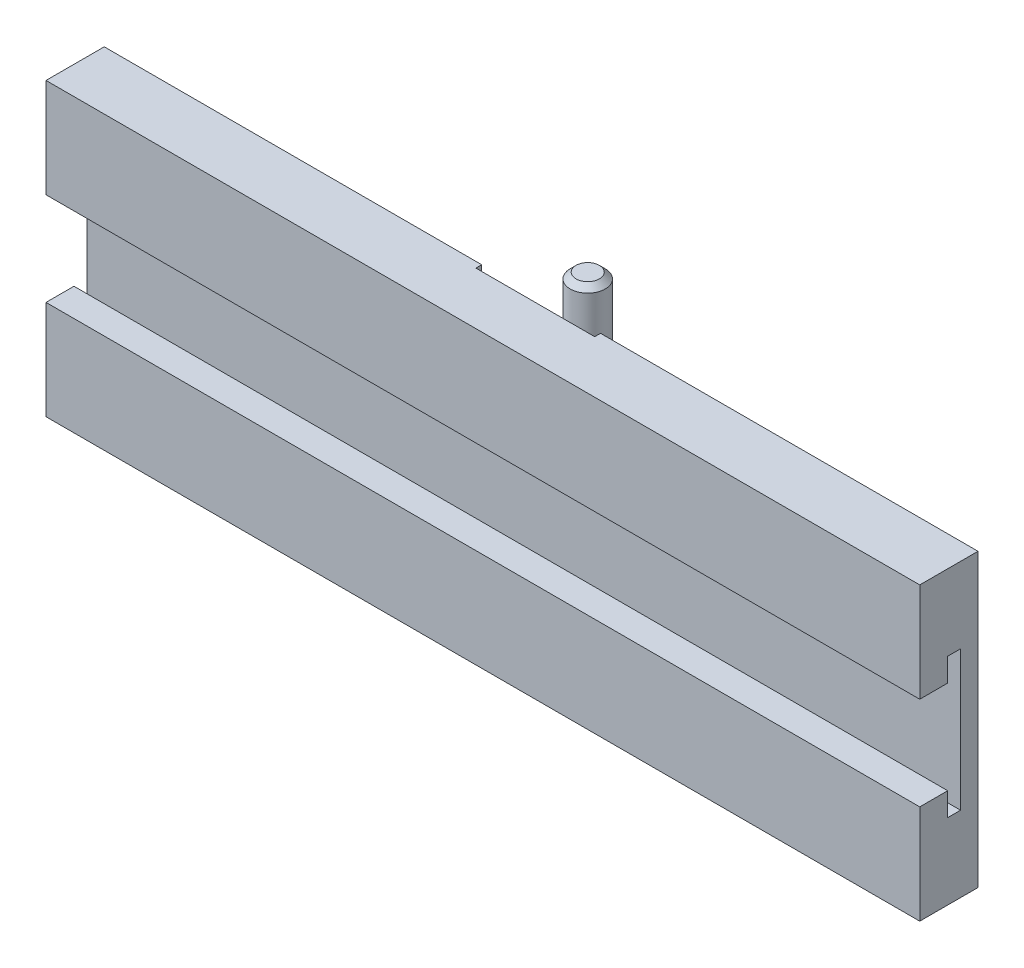
ISO-10303-21;
HEADER;
FILE_DESCRIPTION(('STEP AP214'),'2;1');
FILE_NAME('part.step','',(''),(''),'','','');
FILE_SCHEMA(('AUTOMOTIVE_DESIGN { 1 0 10303 214 1 1 1 1 }'));
ENDSEC;
DATA;
#1=APPLICATION_CONTEXT('core data for automotive mechanical design processes');
#2=APPLICATION_PROTOCOL_DEFINITION('international standard','automotive_design',2000,#1);
#3=PRODUCT_CONTEXT('',#1,'mechanical');
#4=PRODUCT('Part','Part','',(#3));
#5=PRODUCT_RELATED_PRODUCT_CATEGORY('part','',(#4));
#6=PRODUCT_DEFINITION_FORMATION('','',#4);
#7=PRODUCT_DEFINITION_CONTEXT('part definition',#1,'design');
#8=PRODUCT_DEFINITION('design','',#6,#7);
#9=PRODUCT_DEFINITION_SHAPE('','',#8);
#10=(LENGTH_UNIT() NAMED_UNIT(*) SI_UNIT(.MILLI.,.METRE.));
#11=(NAMED_UNIT(*) PLANE_ANGLE_UNIT() SI_UNIT($,.RADIAN.));
#12=(NAMED_UNIT(*) SI_UNIT($,.STERADIAN.) SOLID_ANGLE_UNIT());
#13=UNCERTAINTY_MEASURE_WITH_UNIT(LENGTH_MEASURE(1.E-05),#10,'distance_accuracy_value','');
#14=(GEOMETRIC_REPRESENTATION_CONTEXT(3) GLOBAL_UNCERTAINTY_ASSIGNED_CONTEXT((#13)) GLOBAL_UNIT_ASSIGNED_CONTEXT((#10,
#11,#12)) REPRESENTATION_CONTEXT('',''));
#15=CARTESIAN_POINT('',(0.,0.,0.));
#16=DIRECTION('',(0.,0.,1.));
#17=DIRECTION('',(1.,0.,0.));
#18=AXIS2_PLACEMENT_3D('',#15,#16,#17);
#19=CARTESIAN_POINT('',(40.0694316593444,-100.,0.999999999999995));
#20=DIRECTION('',(0.,0.,1.));
#21=DIRECTION('',(1.,0.,0.));
#22=AXIS2_PLACEMENT_3D('',#19,#20,#21);
#23=PLANE('',#22);
#24=DIRECTION('',(1.,0.,0.));
#25=VECTOR('',#24,1.);
#26=CARTESIAN_POINT('',(40.0694316593444,5.,0.999999999999995));
#27=LINE('',#26,#25);
#28=CARTESIAN_POINT('',(40.0694316593444,5.,0.999999999999995));
#29=VERTEX_POINT('',#28);
#30=CARTESIAN_POINT('',(60.4694316593444,5.,0.999999999999995));
#31=VERTEX_POINT('',#30);
#32=EDGE_CURVE('E197',#29,#31,#27,.T.);
#33=ORIENTED_EDGE('',*,*,#32,.F.);
#34=DIRECTION('',(0.,1.,0.));
#35=VECTOR('',#34,1.);
#36=CARTESIAN_POINT('',(40.0694316593444,-100.,0.999999999999995));
#37=LINE('',#36,#35);
#38=CARTESIAN_POINT('',(40.0694316593444,50.,0.999999999999995));
#39=VERTEX_POINT('',#38);
#40=EDGE_CURVE('E248',#29,#39,#37,.T.);
#41=ORIENTED_EDGE('',*,*,#40,.T.);
#42=DIRECTION('',(1.,0.,0.));
#43=VECTOR('',#42,1.);
#44=CARTESIAN_POINT('',(40.0694316593444,50.,0.999999999999995));
#45=LINE('',#44,#43);
#46=CARTESIAN_POINT('',(60.4694316593444,50.,0.999999999999995));
#47=VERTEX_POINT('',#46);
#48=EDGE_CURVE('E241',#39,#47,#45,.T.);
#49=ORIENTED_EDGE('',*,*,#48,.T.);
#50=DIRECTION('',(0.,1.,0.));
#51=VECTOR('',#50,1.);
#52=CARTESIAN_POINT('',(60.4694316593444,-100.,0.999999999999995));
#53=LINE('',#52,#51);
#54=EDGE_CURVE('E249',#31,#47,#53,.T.);
#55=ORIENTED_EDGE('',*,*,#54,.F.);
#56=EDGE_LOOP('',(#33,#41,#49,#55));
#57=FACE_BOUND('',#56,.T.);
#58=ADVANCED_FACE('F45',(#57),#23,.F.);
#59=CARTESIAN_POINT('',(40.0694316593444,-100.,0.));
#60=DIRECTION('',(-1.,0.,0.));
#61=DIRECTION('',(0.,0.,1.));
#62=AXIS2_PLACEMENT_3D('',#59,#60,#61);
#63=PLANE('',#62);
#64=DIRECTION('',(0.,0.,1.));
#65=VECTOR('',#64,1.);
#66=CARTESIAN_POINT('',(40.0694316593444,5.,-11.));
#67=LINE('',#66,#65);
#68=CARTESIAN_POINT('',(40.0694316593444,5.,0.));
#69=VERTEX_POINT('',#68);
#70=EDGE_CURVE('E233',#69,#29,#67,.T.);
#71=ORIENTED_EDGE('',*,*,#70,.F.);
#72=DIRECTION('',(0.,-1.,0.));
#73=VECTOR('',#72,1.);
#74=CARTESIAN_POINT('',(40.0694316593444,0.,0.));
#75=LINE('',#74,#73);
#76=CARTESIAN_POINT('',(40.0694316593444,50.,0.));
#77=VERTEX_POINT('',#76);
#78=EDGE_CURVE('E388',#77,#69,#75,.T.);
#79=ORIENTED_EDGE('',*,*,#78,.F.);
#80=DIRECTION('',(0.,0.,1.));
#81=VECTOR('',#80,1.);
#82=CARTESIAN_POINT('',(40.0694316593444,50.,0.));
#83=LINE('',#82,#81);
#84=EDGE_CURVE('E237',#77,#39,#83,.T.);
#85=ORIENTED_EDGE('',*,*,#84,.T.);
#86=ORIENTED_EDGE('',*,*,#40,.F.);
#87=EDGE_LOOP('',(#71,#79,#85,#86));
#88=FACE_BOUND('',#87,.T.);
#89=ADVANCED_FACE('F408',(#88),#63,.F.);
#90=CARTESIAN_POINT('',(60.4694316593444,-100.,0.));
#91=DIRECTION('',(1.,0.,0.));
#92=DIRECTION('',(0.,0.,-1.));
#93=AXIS2_PLACEMENT_3D('',#90,#91,#92);
#94=PLANE('',#93);
#95=DIRECTION('',(0.,0.,-1.));
#96=VECTOR('',#95,1.);
#97=CARTESIAN_POINT('',(60.4694316593444,5.,0.));
#98=LINE('',#97,#96);
#99=CARTESIAN_POINT('',(60.4694316593444,5.,0.));
#100=VERTEX_POINT('',#99);
#101=EDGE_CURVE('E392',#31,#100,#98,.T.);
#102=ORIENTED_EDGE('',*,*,#101,.F.);
#103=ORIENTED_EDGE('',*,*,#54,.T.);
#104=DIRECTION('',(0.,0.,-1.));
#105=VECTOR('',#104,1.);
#106=CARTESIAN_POINT('',(60.4694316593444,50.,0.));
#107=LINE('',#106,#105);
#108=CARTESIAN_POINT('',(60.4694316593444,50.,0.));
#109=VERTEX_POINT('',#108);
#110=EDGE_CURVE('E245',#47,#109,#107,.T.);
#111=ORIENTED_EDGE('',*,*,#110,.T.);
#112=DIRECTION('',(0.,1.,0.));
#113=VECTOR('',#112,1.);
#114=CARTESIAN_POINT('',(60.4694316593444,0.,0.));
#115=LINE('',#114,#113);
#116=EDGE_CURVE('E69',#100,#109,#115,.T.);
#117=ORIENTED_EDGE('',*,*,#116,.F.);
#118=EDGE_LOOP('',(#102,#103,#111,#117));
#119=FACE_BOUND('',#118,.T.);
#120=ADVANCED_FACE('F414',(#119),#94,.F.);
#121=CARTESIAN_POINT('',(0.,0.,0.));
#122=DIRECTION('',(0.,0.,1.));
#123=DIRECTION('',(1.,0.,0.));
#124=AXIS2_PLACEMENT_3D('',#121,#122,#123);
#125=PLANE('',#124);
#126=DIRECTION('',(1.,0.,0.));
#127=VECTOR('',#126,1.);
#128=CARTESIAN_POINT('',(-24.7305683406556,50.,0.));
#129=LINE('',#128,#127);
#130=CARTESIAN_POINT('',(-24.7305683406556,50.,0.));
#131=VERTEX_POINT('',#130);
#132=EDGE_CURVE('E364',#131,#77,#129,.T.);
#133=ORIENTED_EDGE('',*,*,#132,.T.);
#134=ORIENTED_EDGE('',*,*,#78,.T.);
#135=CARTESIAN_POINT('',(40.0694316593444,0.,0.));
#136=VERTEX_POINT('',#135);
#137=EDGE_CURVE('E387',#69,#136,#75,.T.);
#138=ORIENTED_EDGE('',*,*,#137,.T.);
#139=DIRECTION('',(1.,0.,0.));
#140=VECTOR('',#139,1.);
#141=CARTESIAN_POINT('',(-24.7305683406556,0.,0.));
#142=LINE('',#141,#140);
#143=CARTESIAN_POINT('',(-24.7305683406556,0.,0.));
#144=VERTEX_POINT('',#143);
#145=EDGE_CURVE('E355',#144,#136,#142,.T.);
#146=ORIENTED_EDGE('',*,*,#145,.F.);
#147=DIRECTION('',(0.,1.,0.));
#148=VECTOR('',#147,1.);
#149=CARTESIAN_POINT('',(-24.7305683406556,0.,0.));
#150=LINE('',#149,#148);
#151=EDGE_CURVE('E340',#144,#131,#150,.T.);
#152=ORIENTED_EDGE('',*,*,#151,.T.);
#153=EDGE_LOOP('',(#133,#134,#138,#146,#152));
#154=FACE_BOUND('',#153,.T.);
#155=ADVANCED_FACE('F458',(#154),#125,.F.);
#156=CARTESIAN_POINT('',(0.,0.,10.));
#157=DIRECTION('',(0.,0.,1.));
#158=DIRECTION('',(1.,0.,0.));
#159=AXIS2_PLACEMENT_3D('',#156,#157,#158);
#160=PLANE('',#159);
#161=DIRECTION('',(1.,0.,0.));
#162=VECTOR('',#161,1.);
#163=CARTESIAN_POINT('',(-24.7305683406556,17.,10.));
#164=LINE('',#163,#162);
#165=CARTESIAN_POINT('',(-24.7305683406556,17.,10.));
#166=VERTEX_POINT('',#165);
#167=CARTESIAN_POINT('',(125.269431659344,17.,10.));
#168=VERTEX_POINT('',#167);
#169=EDGE_CURVE('E326',#166,#168,#164,.T.);
#170=ORIENTED_EDGE('',*,*,#169,.F.);
#171=DIRECTION('',(0.,1.,0.));
#172=VECTOR('',#171,1.);
#173=CARTESIAN_POINT('',(-24.7305683406556,0.,10.));
#174=LINE('',#173,#172);
#175=CARTESIAN_POINT('',(-24.7305683406556,0.,10.));
#176=VERTEX_POINT('',#175);
#177=EDGE_CURVE('E350',#176,#166,#174,.T.);
#178=ORIENTED_EDGE('',*,*,#177,.F.);
#179=DIRECTION('',(1.,0.,0.));
#180=VECTOR('',#179,1.);
#181=CARTESIAN_POINT('',(-24.7305683406556,0.,10.));
#182=LINE('',#181,#180);
#183=CARTESIAN_POINT('',(125.269431659344,0.,10.));
#184=VERTEX_POINT('',#183);
#185=EDGE_CURVE('E335',#176,#184,#182,.T.);
#186=ORIENTED_EDGE('',*,*,#185,.T.);
#187=DIRECTION('',(0.,1.,0.));
#188=VECTOR('',#187,1.);
#189=CARTESIAN_POINT('',(125.269431659344,0.,10.));
#190=LINE('',#189,#188);
#191=EDGE_CURVE('E341',#184,#168,#190,.T.);
#192=ORIENTED_EDGE('',*,*,#191,.T.);
#193=EDGE_LOOP('',(#170,#178,#186,#192));
#194=FACE_BOUND('',#193,.T.);
#195=ADVANCED_FACE('F455',(#194),#160,.T.);
#196=CARTESIAN_POINT('',(-24.7305683406556,0.,10.));
#197=DIRECTION('',(0.,1.,0.));
#198=DIRECTION('',(0.,0.,1.));
#199=AXIS2_PLACEMENT_3D('',#196,#197,#198);
#200=PLANE('',#199);
#201=ORIENTED_EDGE('',*,*,#145,.T.);
#202=DIRECTION('',(0.,0.,1.));
#203=VECTOR('',#202,1.);
#204=CARTESIAN_POINT('',(40.0694316593444,0.,-11.));
#205=LINE('',#204,#203);
#206=CARTESIAN_POINT('',(40.0694316593444,0.,-11.));
#207=VERTEX_POINT('',#206);
#208=EDGE_CURVE('E223',#207,#136,#205,.T.);
#209=ORIENTED_EDGE('',*,*,#208,.F.);
#210=DIRECTION('',(-1.,0.,0.));
#211=VECTOR('',#210,1.);
#212=CARTESIAN_POINT('',(40.0694316593444,0.,-11.));
#213=LINE('',#212,#211);
#214=CARTESIAN_POINT('',(60.4694316593444,0.,-11.));
#215=VERTEX_POINT('',#214);
#216=EDGE_CURVE('E212',#215,#207,#213,.T.);
#217=ORIENTED_EDGE('',*,*,#216,.F.);
#218=DIRECTION('',(0.,0.,1.));
#219=VECTOR('',#218,1.);
#220=CARTESIAN_POINT('',(60.4694316593444,0.,-11.));
#221=LINE('',#220,#219);
#222=CARTESIAN_POINT('',(60.4694316593444,0.,0.));
#223=VERTEX_POINT('',#222);
#224=EDGE_CURVE('E226',#215,#223,#221,.T.);
#225=ORIENTED_EDGE('',*,*,#224,.T.);
#226=CARTESIAN_POINT('',(125.269431659344,0.,0.));
#227=VERTEX_POINT('',#226);
#228=EDGE_CURVE('E313',#223,#227,#142,.T.);
#229=ORIENTED_EDGE('',*,*,#228,.T.);
#230=DIRECTION('',(0.,0.,-1.));
#231=VECTOR('',#230,1.);
#232=CARTESIAN_POINT('',(125.269431659344,0.,10.));
#233=LINE('',#232,#231);
#234=EDGE_CURVE('E380',#184,#227,#233,.T.);
#235=ORIENTED_EDGE('',*,*,#234,.F.);
#236=ORIENTED_EDGE('',*,*,#185,.F.);
#237=DIRECTION('',(0.,0.,-1.));
#238=VECTOR('',#237,1.);
#239=CARTESIAN_POINT('',(-24.7305683406556,0.,10.));
#240=LINE('',#239,#238);
#241=EDGE_CURVE('E354',#176,#144,#240,.T.);
#242=ORIENTED_EDGE('',*,*,#241,.T.);
#243=EDGE_LOOP('',(#201,#209,#217,#225,#229,#235,#236,#242));
#244=FACE_BOUND('',#243,.T.);
#245=ADVANCED_FACE('F468',(#244),#200,.F.);
#246=CARTESIAN_POINT('',(125.269431659344,0.,10.));
#247=DIRECTION('',(-1.,0.,0.));
#248=DIRECTION('',(0.,0.,1.));
#249=AXIS2_PLACEMENT_3D('',#246,#247,#248);
#250=PLANE('',#249);
#251=DIRECTION('',(0.,-1.,0.));
#252=VECTOR('',#251,1.);
#253=CARTESIAN_POINT('',(125.269431659344,13.,5.2));
#254=LINE('',#253,#252);
#255=CARTESIAN_POINT('',(125.269431659344,17.,5.2));
#256=VERTEX_POINT('',#255);
#257=CARTESIAN_POINT('',(125.269431659344,13.,5.2));
#258=VERTEX_POINT('',#257);
#259=EDGE_CURVE('E295',#256,#258,#254,.T.);
#260=ORIENTED_EDGE('',*,*,#259,.F.);
#261=DIRECTION('',(0.,0.,-1.));
#262=VECTOR('',#261,1.);
#263=CARTESIAN_POINT('',(125.269431659344,17.,5.2));
#264=LINE('',#263,#262);
#265=EDGE_CURVE('E291',#168,#256,#264,.T.);
#266=ORIENTED_EDGE('',*,*,#265,.F.);
#267=ORIENTED_EDGE('',*,*,#191,.F.);
#268=ORIENTED_EDGE('',*,*,#234,.T.);
#269=DIRECTION('',(0.,1.,0.));
#270=VECTOR('',#269,1.);
#271=CARTESIAN_POINT('',(125.269431659344,0.,0.));
#272=LINE('',#271,#270);
#273=CARTESIAN_POINT('',(125.269431659344,50.,0.));
#274=VERTEX_POINT('',#273);
#275=EDGE_CURVE('E359',#227,#274,#272,.T.);
#276=ORIENTED_EDGE('',*,*,#275,.T.);
#277=DIRECTION('',(0.,0.,-1.));
#278=VECTOR('',#277,1.);
#279=CARTESIAN_POINT('',(125.269431659344,50.,10.));
#280=LINE('',#279,#278);
#281=CARTESIAN_POINT('',(125.269431659344,50.,10.));
#282=VERTEX_POINT('',#281);
#283=EDGE_CURVE('E376',#282,#274,#280,.T.);
#284=ORIENTED_EDGE('',*,*,#283,.F.);
#285=CARTESIAN_POINT('',(125.269431659344,33.,10.));
#286=VERTEX_POINT('',#285);
#287=EDGE_CURVE('E339',#286,#282,#190,.T.);
#288=ORIENTED_EDGE('',*,*,#287,.F.);
#289=DIRECTION('',(0.,0.,1.));
#290=VECTOR('',#289,1.);
#291=CARTESIAN_POINT('',(125.269431659344,33.,5.2));
#292=LINE('',#291,#290);
#293=CARTESIAN_POINT('',(125.269431659344,33.,5.2));
#294=VERTEX_POINT('',#293);
#295=EDGE_CURVE('E288',#294,#286,#292,.T.);
#296=ORIENTED_EDGE('',*,*,#295,.F.);
#297=DIRECTION('',(0.,-1.,0.));
#298=VECTOR('',#297,1.);
#299=CARTESIAN_POINT('',(125.269431659344,37.,5.2));
#300=LINE('',#299,#298);
#301=CARTESIAN_POINT('',(125.269431659344,37.,5.2));
#302=VERTEX_POINT('',#301);
#303=EDGE_CURVE('E252',#302,#294,#300,.T.);
#304=ORIENTED_EDGE('',*,*,#303,.F.);
#305=DIRECTION('',(0.,0.,1.));
#306=VECTOR('',#305,1.);
#307=CARTESIAN_POINT('',(125.269431659344,37.,3.));
#308=LINE('',#307,#306);
#309=CARTESIAN_POINT('',(125.269431659344,37.,3.));
#310=VERTEX_POINT('',#309);
#311=EDGE_CURVE('E260',#310,#302,#308,.T.);
#312=ORIENTED_EDGE('',*,*,#311,.F.);
#313=DIRECTION('',(0.,1.,0.));
#314=VECTOR('',#313,1.);
#315=CARTESIAN_POINT('',(125.269431659344,13.,3.));
#316=LINE('',#315,#314);
#317=CARTESIAN_POINT('',(125.269431659344,13.,3.));
#318=VERTEX_POINT('',#317);
#319=EDGE_CURVE('E303',#318,#310,#316,.T.);
#320=ORIENTED_EDGE('',*,*,#319,.F.);
#321=DIRECTION('',(0.,0.,-1.));
#322=VECTOR('',#321,1.);
#323=CARTESIAN_POINT('',(125.269431659344,13.,3.));
#324=LINE('',#323,#322);
#325=EDGE_CURVE('E299',#258,#318,#324,.T.);
#326=ORIENTED_EDGE('',*,*,#325,.F.);
#327=EDGE_LOOP('',(#260,#266,#267,#268,#276,#284,#288,#296,#304,#312,#320,#326));
#328=FACE_BOUND('',#327,.T.);
#329=ADVANCED_FACE('F465',(#328),#250,.F.);
#330=CARTESIAN_POINT('',(-24.7305683406556,50.,10.));
#331=DIRECTION('',(0.,1.,0.));
#332=DIRECTION('',(0.,0.,1.));
#333=AXIS2_PLACEMENT_3D('',#330,#331,#332);
#334=PLANE('',#333);
#335=ORIENTED_EDGE('',*,*,#84,.F.);
#336=ORIENTED_EDGE('',*,*,#132,.F.);
#337=DIRECTION('',(0.,0.,-1.));
#338=VECTOR('',#337,1.);
#339=CARTESIAN_POINT('',(-24.7305683406556,50.,10.));
#340=LINE('',#339,#338);
#341=CARTESIAN_POINT('',(-24.7305683406556,50.,10.));
#342=VERTEX_POINT('',#341);
#343=EDGE_CURVE('E373',#342,#131,#340,.T.);
#344=ORIENTED_EDGE('',*,*,#343,.F.);
#345=DIRECTION('',(1.,0.,0.));
#346=VECTOR('',#345,1.);
#347=CARTESIAN_POINT('',(-24.7305683406556,50.,10.));
#348=LINE('',#347,#346);
#349=EDGE_CURVE('E345',#342,#282,#348,.T.);
#350=ORIENTED_EDGE('',*,*,#349,.T.);
#351=ORIENTED_EDGE('',*,*,#283,.T.);
#352=EDGE_CURVE('E363',#109,#274,#129,.T.);
#353=ORIENTED_EDGE('',*,*,#352,.F.);
#354=ORIENTED_EDGE('',*,*,#110,.F.);
#355=ORIENTED_EDGE('',*,*,#48,.F.);
#356=EDGE_LOOP('',(#335,#336,#344,#350,#351,#353,#354,#355));
#357=FACE_BOUND('',#356,.T.);
#358=ADVANCED_FACE('F461',(#357),#334,.T.);
#359=CARTESIAN_POINT('',(-24.7305683406556,0.,10.));
#360=DIRECTION('',(-1.,0.,0.));
#361=DIRECTION('',(0.,0.,1.));
#362=AXIS2_PLACEMENT_3D('',#359,#360,#361);
#363=PLANE('',#362);
#364=DIRECTION('',(0.,0.,-1.));
#365=VECTOR('',#364,1.);
#366=CARTESIAN_POINT('',(-24.7305683406556,17.,5.2));
#367=LINE('',#366,#365);
#368=CARTESIAN_POINT('',(-24.7305683406556,17.,5.2));
#369=VERTEX_POINT('',#368);
#370=EDGE_CURVE('E264',#166,#369,#367,.T.);
#371=ORIENTED_EDGE('',*,*,#370,.T.);
#372=DIRECTION('',(0.,-1.,0.));
#373=VECTOR('',#372,1.);
#374=CARTESIAN_POINT('',(-24.7305683406556,13.,5.2));
#375=LINE('',#374,#373);
#376=CARTESIAN_POINT('',(-24.7305683406556,13.,5.2));
#377=VERTEX_POINT('',#376);
#378=EDGE_CURVE('E268',#369,#377,#375,.T.);
#379=ORIENTED_EDGE('',*,*,#378,.T.);
#380=DIRECTION('',(0.,0.,-1.));
#381=VECTOR('',#380,1.);
#382=CARTESIAN_POINT('',(-24.7305683406556,13.,3.));
#383=LINE('',#382,#381);
#384=CARTESIAN_POINT('',(-24.7305683406556,13.,3.));
#385=VERTEX_POINT('',#384);
#386=EDGE_CURVE('E272',#377,#385,#383,.T.);
#387=ORIENTED_EDGE('',*,*,#386,.T.);
#388=DIRECTION('',(0.,1.,0.));
#389=VECTOR('',#388,1.);
#390=CARTESIAN_POINT('',(-24.7305683406556,13.,3.));
#391=LINE('',#390,#389);
#392=CARTESIAN_POINT('',(-24.7305683406556,37.,3.));
#393=VERTEX_POINT('',#392);
#394=EDGE_CURVE('E276',#385,#393,#391,.T.);
#395=ORIENTED_EDGE('',*,*,#394,.T.);
#396=DIRECTION('',(0.,0.,1.));
#397=VECTOR('',#396,1.);
#398=CARTESIAN_POINT('',(-24.7305683406556,37.,3.));
#399=LINE('',#398,#397);
#400=CARTESIAN_POINT('',(-24.7305683406556,37.,5.2));
#401=VERTEX_POINT('',#400);
#402=EDGE_CURVE('E280',#393,#401,#399,.T.);
#403=ORIENTED_EDGE('',*,*,#402,.T.);
#404=DIRECTION('',(0.,-1.,0.));
#405=VECTOR('',#404,1.);
#406=CARTESIAN_POINT('',(-24.7305683406556,37.,5.2));
#407=LINE('',#406,#405);
#408=CARTESIAN_POINT('',(-24.7305683406556,33.,5.2));
#409=VERTEX_POINT('',#408);
#410=EDGE_CURVE('E255',#401,#409,#407,.T.);
#411=ORIENTED_EDGE('',*,*,#410,.T.);
#412=DIRECTION('',(0.,0.,1.));
#413=VECTOR('',#412,1.);
#414=CARTESIAN_POINT('',(-24.7305683406556,33.,5.2));
#415=LINE('',#414,#413);
#416=CARTESIAN_POINT('',(-24.7305683406556,33.,10.));
#417=VERTEX_POINT('',#416);
#418=EDGE_CURVE('E259',#409,#417,#415,.T.);
#419=ORIENTED_EDGE('',*,*,#418,.T.);
#420=EDGE_CURVE('E349',#417,#342,#174,.T.);
#421=ORIENTED_EDGE('',*,*,#420,.T.);
#422=ORIENTED_EDGE('',*,*,#343,.T.);
#423=ORIENTED_EDGE('',*,*,#151,.F.);
#424=ORIENTED_EDGE('',*,*,#241,.F.);
#425=ORIENTED_EDGE('',*,*,#177,.T.);
#426=EDGE_LOOP('',(#371,#379,#387,#395,#403,#411,#419,#421,#422,#423,#424,#425));
#427=FACE_BOUND('',#426,.T.);
#428=ADVANCED_FACE('F453',(#427),#363,.T.);
#429=DIRECTION('',(1.,0.,0.));
#430=VECTOR('',#429,1.);
#431=CARTESIAN_POINT('',(-24.7305683406556,33.,10.));
#432=LINE('',#431,#430);
#433=EDGE_CURVE('E329',#417,#286,#432,.T.);
#434=ORIENTED_EDGE('',*,*,#433,.T.);
#435=ORIENTED_EDGE('',*,*,#287,.T.);
#436=ORIENTED_EDGE('',*,*,#349,.F.);
#437=ORIENTED_EDGE('',*,*,#420,.F.);
#438=EDGE_LOOP('',(#434,#435,#436,#437));
#439=FACE_BOUND('',#438,.T.);
#440=ADVANCED_FACE('F450',(#439),#160,.T.);
#441=ORIENTED_EDGE('',*,*,#228,.F.);
#442=EDGE_CURVE('E384',#223,#100,#115,.T.);
#443=ORIENTED_EDGE('',*,*,#442,.T.);
#444=ORIENTED_EDGE('',*,*,#116,.T.);
#445=ORIENTED_EDGE('',*,*,#352,.T.);
#446=ORIENTED_EDGE('',*,*,#275,.F.);
#447=EDGE_LOOP('',(#441,#443,#444,#445,#446));
#448=FACE_BOUND('',#447,.T.);
#449=ADVANCED_FACE('F448',(#448),#125,.F.);
#450=CARTESIAN_POINT('',(-24.7305683406556,37.,5.2));
#451=DIRECTION('',(0.,0.,1.));
#452=DIRECTION('',(0.,-1.,0.));
#453=AXIS2_PLACEMENT_3D('',#450,#451,#452);
#454=PLANE('',#453);
#455=ORIENTED_EDGE('',*,*,#303,.T.);
#456=DIRECTION('',(1.,0.,0.));
#457=VECTOR('',#456,1.);
#458=CARTESIAN_POINT('',(-24.7305683406556,33.,5.2));
#459=LINE('',#458,#457);
#460=EDGE_CURVE('E284',#409,#294,#459,.T.);
#461=ORIENTED_EDGE('',*,*,#460,.F.);
#462=ORIENTED_EDGE('',*,*,#410,.F.);
#463=DIRECTION('',(1.,0.,0.));
#464=VECTOR('',#463,1.);
#465=CARTESIAN_POINT('',(-24.7305683406556,37.,5.2));
#466=LINE('',#465,#464);
#467=EDGE_CURVE('E310',#401,#302,#466,.T.);
#468=ORIENTED_EDGE('',*,*,#467,.T.);
#469=EDGE_LOOP('',(#455,#461,#462,#468));
#470=FACE_BOUND('',#469,.T.);
#471=ADVANCED_FACE('F424',(#470),#454,.F.);
#472=CARTESIAN_POINT('',(-24.7305683406556,37.,3.));
#473=DIRECTION('',(0.,1.,0.));
#474=DIRECTION('',(0.,0.,1.));
#475=AXIS2_PLACEMENT_3D('',#472,#473,#474);
#476=PLANE('',#475);
#477=ORIENTED_EDGE('',*,*,#311,.T.);
#478=ORIENTED_EDGE('',*,*,#467,.F.);
#479=ORIENTED_EDGE('',*,*,#402,.F.);
#480=DIRECTION('',(1.,0.,0.));
#481=VECTOR('',#480,1.);
#482=CARTESIAN_POINT('',(-24.7305683406556,37.,3.));
#483=LINE('',#482,#481);
#484=EDGE_CURVE('E314',#393,#310,#483,.T.);
#485=ORIENTED_EDGE('',*,*,#484,.T.);
#486=EDGE_LOOP('',(#477,#478,#479,#485));
#487=FACE_BOUND('',#486,.T.);
#488=ADVANCED_FACE('F420',(#487),#476,.F.);
#489=CARTESIAN_POINT('',(-24.7305683406556,13.,3.));
#490=DIRECTION('',(0.,0.,-1.));
#491=DIRECTION('',(0.,1.,0.));
#492=AXIS2_PLACEMENT_3D('',#489,#490,#491);
#493=PLANE('',#492);
#494=ORIENTED_EDGE('',*,*,#319,.T.);
#495=ORIENTED_EDGE('',*,*,#484,.F.);
#496=ORIENTED_EDGE('',*,*,#394,.F.);
#497=DIRECTION('',(1.,0.,0.));
#498=VECTOR('',#497,1.);
#499=CARTESIAN_POINT('',(-24.7305683406556,13.,3.));
#500=LINE('',#499,#498);
#501=EDGE_CURVE('E317',#385,#318,#500,.T.);
#502=ORIENTED_EDGE('',*,*,#501,.T.);
#503=EDGE_LOOP('',(#494,#495,#496,#502));
#504=FACE_BOUND('',#503,.T.);
#505=ADVANCED_FACE('F423',(#504),#493,.F.);
#506=CARTESIAN_POINT('',(-24.7305683406556,13.,3.));
#507=DIRECTION('',(0.,-1.,0.));
#508=DIRECTION('',(0.,0.,-1.));
#509=AXIS2_PLACEMENT_3D('',#506,#507,#508);
#510=PLANE('',#509);
#511=ORIENTED_EDGE('',*,*,#325,.T.);
#512=ORIENTED_EDGE('',*,*,#501,.F.);
#513=ORIENTED_EDGE('',*,*,#386,.F.);
#514=DIRECTION('',(1.,0.,0.));
#515=VECTOR('',#514,1.);
#516=CARTESIAN_POINT('',(-24.7305683406556,13.,5.2));
#517=LINE('',#516,#515);
#518=EDGE_CURVE('E320',#377,#258,#517,.T.);
#519=ORIENTED_EDGE('',*,*,#518,.T.);
#520=EDGE_LOOP('',(#511,#512,#513,#519));
#521=FACE_BOUND('',#520,.T.);
#522=ADVANCED_FACE('F428',(#521),#510,.F.);
#523=CARTESIAN_POINT('',(-24.7305683406556,13.,5.2));
#524=DIRECTION('',(0.,0.,1.));
#525=DIRECTION('',(0.,-1.,0.));
#526=AXIS2_PLACEMENT_3D('',#523,#524,#525);
#527=PLANE('',#526);
#528=ORIENTED_EDGE('',*,*,#259,.T.);
#529=ORIENTED_EDGE('',*,*,#518,.F.);
#530=ORIENTED_EDGE('',*,*,#378,.F.);
#531=DIRECTION('',(1.,0.,0.));
#532=VECTOR('',#531,1.);
#533=CARTESIAN_POINT('',(-24.7305683406556,17.,5.2));
#534=LINE('',#533,#532);
#535=EDGE_CURVE('E323',#369,#256,#534,.T.);
#536=ORIENTED_EDGE('',*,*,#535,.T.);
#537=EDGE_LOOP('',(#528,#529,#530,#536));
#538=FACE_BOUND('',#537,.T.);
#539=ADVANCED_FACE('F432',(#538),#527,.F.);
#540=CARTESIAN_POINT('',(-24.7305683406556,17.,5.2));
#541=DIRECTION('',(0.,-1.,0.));
#542=DIRECTION('',(0.,0.,-1.));
#543=AXIS2_PLACEMENT_3D('',#540,#541,#542);
#544=PLANE('',#543);
#545=ORIENTED_EDGE('',*,*,#265,.T.);
#546=ORIENTED_EDGE('',*,*,#535,.F.);
#547=ORIENTED_EDGE('',*,*,#370,.F.);
#548=ORIENTED_EDGE('',*,*,#169,.T.);
#549=EDGE_LOOP('',(#545,#546,#547,#548));
#550=FACE_BOUND('',#549,.T.);
#551=ADVANCED_FACE('F436',(#550),#544,.F.);
#552=CARTESIAN_POINT('',(-24.7305683406556,33.,5.2));
#553=DIRECTION('',(0.,1.,0.));
#554=DIRECTION('',(0.,0.,1.));
#555=AXIS2_PLACEMENT_3D('',#552,#553,#554);
#556=PLANE('',#555);
#557=ORIENTED_EDGE('',*,*,#295,.T.);
#558=ORIENTED_EDGE('',*,*,#433,.F.);
#559=ORIENTED_EDGE('',*,*,#418,.F.);
#560=ORIENTED_EDGE('',*,*,#460,.T.);
#561=EDGE_LOOP('',(#557,#558,#559,#560));
#562=FACE_BOUND('',#561,.T.);
#563=ADVANCED_FACE('F440',(#562),#556,.F.);
#564=CARTESIAN_POINT('',(40.0694316593444,0.,-11.));
#565=DIRECTION('',(1.,0.,0.));
#566=DIRECTION('',(0.,0.,-1.));
#567=AXIS2_PLACEMENT_3D('',#564,#565,#566);
#568=PLANE('',#567);
#569=ORIENTED_EDGE('',*,*,#208,.T.);
#570=ORIENTED_EDGE('',*,*,#137,.F.);
#571=CARTESIAN_POINT('',(40.0694316593444,5.,-11.));
#572=VERTEX_POINT('',#571);
#573=EDGE_CURVE('E234',#572,#69,#67,.T.);
#574=ORIENTED_EDGE('',*,*,#573,.F.);
#575=DIRECTION('',(0.,1.,0.));
#576=VECTOR('',#575,1.);
#577=CARTESIAN_POINT('',(40.0694316593444,0.,-11.));
#578=LINE('',#577,#576);
#579=EDGE_CURVE('E207',#207,#572,#578,.T.);
#580=ORIENTED_EDGE('',*,*,#579,.F.);
#581=EDGE_LOOP('',(#569,#570,#574,#580));
#582=FACE_BOUND('',#581,.T.);
#583=ADVANCED_FACE('F444',(#582),#568,.F.);
#584=CARTESIAN_POINT('',(60.4694316593444,0.,-11.));
#585=DIRECTION('',(-1.,0.,0.));
#586=DIRECTION('',(0.,0.,1.));
#587=AXIS2_PLACEMENT_3D('',#584,#585,#586);
#588=PLANE('',#587);
#589=DIRECTION('',(0.,0.,1.));
#590=VECTOR('',#589,1.);
#591=CARTESIAN_POINT('',(60.4694316593444,5.,-11.));
#592=LINE('',#591,#590);
#593=CARTESIAN_POINT('',(60.4694316593444,5.,-11.));
#594=VERTEX_POINT('',#593);
#595=EDGE_CURVE('E229',#594,#100,#592,.T.);
#596=ORIENTED_EDGE('',*,*,#595,.T.);
#597=ORIENTED_EDGE('',*,*,#442,.F.);
#598=ORIENTED_EDGE('',*,*,#224,.F.);
#599=DIRECTION('',(0.,-1.,0.));
#600=VECTOR('',#599,1.);
#601=CARTESIAN_POINT('',(60.4694316593444,0.,-11.));
#602=LINE('',#601,#600);
#603=EDGE_CURVE('E210',#594,#215,#602,.T.);
#604=ORIENTED_EDGE('',*,*,#603,.F.);
#605=EDGE_LOOP('',(#596,#597,#598,#604));
#606=FACE_BOUND('',#605,.T.);
#607=ADVANCED_FACE('F500',(#606),#588,.F.);
#608=CARTESIAN_POINT('',(40.0694316593444,5.,-11.));
#609=DIRECTION('',(0.,-1.,0.));
#610=DIRECTION('',(1.,0.,0.));
#611=AXIS2_PLACEMENT_3D('',#608,#609,#610);
#612=PLANE('',#611);
#613=CARTESIAN_POINT('',(50.2694316593444,5.,-8.));
#614=DIRECTION('',(0.,1.,0.));
#615=DIRECTION('',(-1.,0.,0.));
#616=AXIS2_PLACEMENT_3D('',#613,#614,#615);
#617=CIRCLE('',#616,3.01);
#618=CARTESIAN_POINT('',(50.0242786459018,5.,-11.));
#619=VERTEX_POINT('',#618);
#620=CARTESIAN_POINT('',(50.514584672787,5.,-11.));
#621=VERTEX_POINT('',#620);
#622=EDGE_CURVE('E194',#619,#621,#617,.T.);
#623=ORIENTED_EDGE('',*,*,#622,.F.);
#624=DIRECTION('',(1.,0.,0.));
#625=VECTOR('',#624,1.);
#626=CARTESIAN_POINT('',(40.0694316593444,5.,-11.));
#627=LINE('',#626,#625);
#628=EDGE_CURVE('E188',#572,#619,#627,.T.);
#629=ORIENTED_EDGE('',*,*,#628,.F.);
#630=ORIENTED_EDGE('',*,*,#573,.T.);
#631=ORIENTED_EDGE('',*,*,#70,.T.);
#632=ORIENTED_EDGE('',*,*,#32,.T.);
#633=ORIENTED_EDGE('',*,*,#101,.T.);
#634=ORIENTED_EDGE('',*,*,#595,.F.);
#635=EDGE_CURVE('E189',#621,#594,#627,.T.);
#636=ORIENTED_EDGE('',*,*,#635,.F.);
#637=EDGE_LOOP('',(#623,#629,#630,#631,#632,#633,#634,#636));
#638=FACE_BOUND('',#637,.T.);
#639=ADVANCED_FACE('F200',(#638),#612,.F.);
#640=CARTESIAN_POINT('',(0.,0.,-11.));
#641=DIRECTION('',(0.,0.,-1.));
#642=DIRECTION('',(-1.,0.,0.));
#643=AXIS2_PLACEMENT_3D('',#640,#641,#642);
#644=PLANE('',#643);
#645=ORIENTED_EDGE('',*,*,#579,.T.);
#646=ORIENTED_EDGE('',*,*,#628,.T.);
#647=EDGE_CURVE('E183',#619,#621,#627,.T.);
#648=ORIENTED_EDGE('',*,*,#647,.T.);
#649=ORIENTED_EDGE('',*,*,#635,.T.);
#650=ORIENTED_EDGE('',*,*,#603,.T.);
#651=ORIENTED_EDGE('',*,*,#216,.T.);
#652=EDGE_LOOP('',(#645,#646,#648,#649,#650,#651));
#653=FACE_BOUND('',#652,.T.);
#654=ADVANCED_FACE('F205',(#653),#644,.T.);
#655=CARTESIAN_POINT('',(50.2694316593444,50.,-8.));
#656=DIRECTION('',(0.,-1.,0.));
#657=DIRECTION('',(1.,0.,0.));
#658=AXIS2_PLACEMENT_3D('',#655,#656,#657);
#659=CYLINDRICAL_SURFACE('',#658,3.01);
#660=CARTESIAN_POINT('',(50.2694316593444,49.,-8.));
#661=DIRECTION('',(0.,1.,0.));
#662=DIRECTION('',(0.,0.,1.));
#663=AXIS2_PLACEMENT_3D('',#660,#661,#662);
#664=CIRCLE('',#663,3.01);
#665=CARTESIAN_POINT('',(50.2694316593444,49.,-4.99000000000001));
#666=VERTEX_POINT('',#665);
#667=EDGE_CURVE('E11',#666,#666,#664,.F.);
#668=ORIENTED_EDGE('',*,*,#667,.T.);
#669=EDGE_LOOP('',(#668));
#670=FACE_BOUND('',#669,.T.);
#671=EDGE_CURVE('E61',#621,#619,#617,.T.);
#672=ORIENTED_EDGE('',*,*,#671,.T.);
#673=ORIENTED_EDGE('',*,*,#622,.T.);
#674=EDGE_LOOP('',(#672,#673));
#675=FACE_BOUND('',#674,.T.);
#676=ADVANCED_FACE('F193',(#670,#675),#659,.T.);
#677=CARTESIAN_POINT('',(50.2694316593444,50.,-8.));
#678=DIRECTION('',(0.,1.,0.));
#679=DIRECTION('',(-1.,0.,0.));
#680=AXIS2_PLACEMENT_3D('',#677,#678,#679);
#681=PLANE('',#680);
#682=CARTESIAN_POINT('',(50.2694316593444,50.,-8.));
#683=DIRECTION('',(0.,1.,0.));
#684=DIRECTION('',(-1.,0.,0.));
#685=AXIS2_PLACEMENT_3D('',#682,#683,#684);
#686=CIRCLE('',#685,2.01000000000007);
#687=CARTESIAN_POINT('',(48.2594316593443,50.,-8.));
#688=VERTEX_POINT('',#687);
#689=EDGE_CURVE('E55',#688,#688,#686,.T.);
#690=ORIENTED_EDGE('',*,*,#689,.T.);
#691=EDGE_LOOP('',(#690));
#692=FACE_BOUND('',#691,.T.);
#693=ADVANCED_FACE('F398',(#692),#681,.T.);
#694=CARTESIAN_POINT('',(50.2694316593444,5.,-8.));
#695=DIRECTION('',(0.,1.,0.));
#696=DIRECTION('',(-1.,0.,0.));
#697=AXIS2_PLACEMENT_3D('',#694,#695,#696);
#698=PLANE('',#697);
#699=ORIENTED_EDGE('',*,*,#647,.F.);
#700=ORIENTED_EDGE('',*,*,#671,.F.);
#701=EDGE_LOOP('',(#699,#700));
#702=FACE_BOUND('',#701,.T.);
#703=ADVANCED_FACE('F184',(#702),#698,.F.);
#704=CARTESIAN_POINT('',(50.2694316593444,50.,-8.));
#705=DIRECTION('',(0.,-1.,0.));
#706=DIRECTION('',(0.,0.,-1.));
#707=AXIS2_PLACEMENT_3D('',#704,#705,#706);
#708=CONICAL_SURFACE('',#707,2.01000000000007,0.785398163397441);
#709=ORIENTED_EDGE('',*,*,#667,.F.);
#710=EDGE_LOOP('',(#709));
#711=FACE_BOUND('',#710,.T.);
#712=ORIENTED_EDGE('',*,*,#689,.F.);
#713=EDGE_LOOP('',(#712));
#714=FACE_BOUND('',#713,.T.);
#715=ADVANCED_FACE('F48',(#711,#714),#708,.T.);
#716=CLOSED_SHELL('',(#58,#89,#120,#155,#195,#245,#329,#358,#428,#440,#449,#471,#488,#505,#522,
#539,#551,#563,#583,#607,#639,#654,#676,#693,#703,#715));
#717=MANIFOLD_SOLID_BREP('B2',#716);
#718=ADVANCED_BREP_SHAPE_REPRESENTATION('',(#18,#717),#14);
#719=SHAPE_DEFINITION_REPRESENTATION(#9,#718);
ENDSEC;
END-ISO-10303-21;
